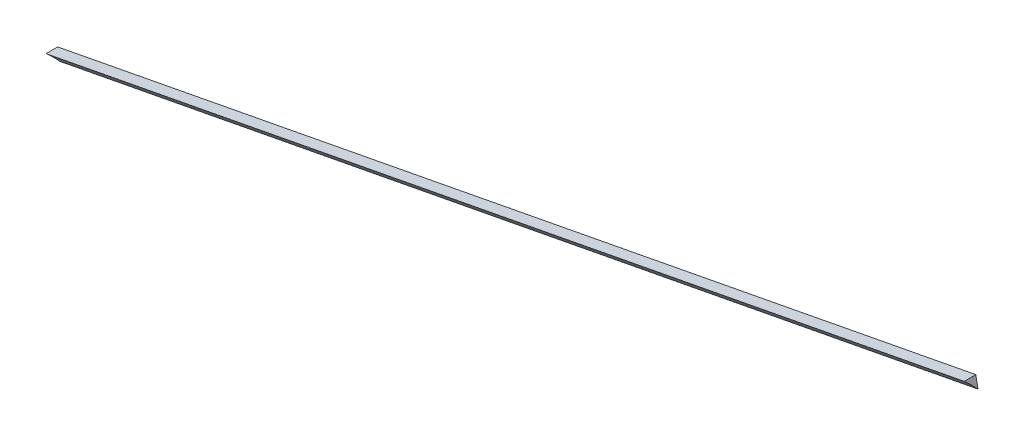
ISO-10303-21;
HEADER;
FILE_DESCRIPTION(('STEP AP214'),'2;1');
FILE_NAME('part.step','',(''),(''),'','','');
FILE_SCHEMA(('AUTOMOTIVE_DESIGN { 1 0 10303 214 1 1 1 1 }'));
ENDSEC;
DATA;
#1=APPLICATION_CONTEXT('core data for automotive mechanical design processes');
#2=APPLICATION_PROTOCOL_DEFINITION('international standard','automotive_design',2000,#1);
#3=PRODUCT_CONTEXT('',#1,'mechanical');
#4=PRODUCT('Part','Part','',(#3));
#5=PRODUCT_RELATED_PRODUCT_CATEGORY('part','',(#4));
#6=PRODUCT_DEFINITION_FORMATION('','',#4);
#7=PRODUCT_DEFINITION_CONTEXT('part definition',#1,'design');
#8=PRODUCT_DEFINITION('design','',#6,#7);
#9=PRODUCT_DEFINITION_SHAPE('','',#8);
#10=(LENGTH_UNIT() NAMED_UNIT(*) SI_UNIT(.MILLI.,.METRE.));
#11=(NAMED_UNIT(*) PLANE_ANGLE_UNIT() SI_UNIT($,.RADIAN.));
#12=(NAMED_UNIT(*) SI_UNIT($,.STERADIAN.) SOLID_ANGLE_UNIT());
#13=UNCERTAINTY_MEASURE_WITH_UNIT(LENGTH_MEASURE(1.E-05),#10,'distance_accuracy_value','');
#14=(GEOMETRIC_REPRESENTATION_CONTEXT(3) GLOBAL_UNCERTAINTY_ASSIGNED_CONTEXT((#13)) GLOBAL_UNIT_ASSIGNED_CONTEXT((#10,
#11,#12)) REPRESENTATION_CONTEXT('',''));
#15=CARTESIAN_POINT('',(0.,0.,0.));
#16=DIRECTION('',(0.,0.,1.));
#17=DIRECTION('',(1.,0.,0.));
#18=AXIS2_PLACEMENT_3D('',#15,#16,#17);
#19=CARTESIAN_POINT('',(1540.625,-104.467938085316,0.));
#20=DIRECTION('',(0.,0.,1.));
#21=DIRECTION('',(0.187499999999999,-0.982264602843857,0.));
#22=AXIS2_PLACEMENT_3D('',#19,#20,#21);
#23=PLANE('',#22);
#24=DIRECTION('',(0.187499999999999,-0.982264602843857,0.));
#25=VECTOR('',#24,1.);
#26=CARTESIAN_POINT('',(754.813317724915,-254.467938085315,0.));
#27=LINE('',#26,#25);
#28=CARTESIAN_POINT('',(749.188317724915,-225.,0.));
#29=VERTEX_POINT('',#28);
#30=CARTESIAN_POINT('',(751.063317725042,-234.822646029021,2.06861990474389E-10));
#31=VERTEX_POINT('',#30);
#32=EDGE_CURVE('E107',#29,#31,#27,.T.);
#33=ORIENTED_EDGE('',*,*,#32,.F.);
#34=DIRECTION('',(-0.982264602843857,-0.1875,0.));
#35=VECTOR('',#34,1.);
#36=CARTESIAN_POINT('',(1535.,-75.,0.));
#37=LINE('',#36,#35);
#38=CARTESIAN_POINT('',(1535.,-75.,0.));
#39=VERTEX_POINT('',#38);
#40=EDGE_CURVE('E87',#39,#29,#37,.T.);
#41=ORIENTED_EDGE('',*,*,#40,.F.);
#42=DIRECTION('',(-0.187499999999999,0.982264602843857,0.));
#43=VECTOR('',#42,1.);
#44=CARTESIAN_POINT('',(1540.625,-104.467938085316,0.));
#45=LINE('',#44,#43);
#46=CARTESIAN_POINT('',(1536.87500000001,-84.822646028422,1.20733608039053E-11));
#47=VERTEX_POINT('',#46);
#48=EDGE_CURVE('E90',#47,#39,#45,.T.);
#49=ORIENTED_EDGE('',*,*,#48,.F.);
#50=DIRECTION('',(-0.982264602843767,-0.187500000000474,4.87079449789036E-13));
#51=VECTOR('',#50,1.);
#52=CARTESIAN_POINT('',(1536.87499999999,-84.8226460284114,2.40779618465581E-11));
#53=LINE('',#52,#51);
#54=EDGE_CURVE('E61',#31,#47,#53,.F.);
#55=ORIENTED_EDGE('',*,*,#54,.F.);
#56=EDGE_LOOP('',(#33,#41,#49,#55));
#57=FACE_BOUND('',#56,.T.);
#58=ADVANCED_FACE('F57',(#57),#23,.F.);
#59=CARTESIAN_POINT('',(763.36749705697,-299.281098428057,75.6222897710008));
#60=DIRECTION('',(0.982264602843867,0.187499999999948,0.));
#61=DIRECTION('',(-0.187499999999948,0.982264602843867,0.));
#62=AXIS2_PLACEMENT_3D('',#59,#60,#61);
#63=PLANE('',#62);
#64=DIRECTION('',(0.,0.,-1.));
#65=VECTOR('',#64,1.);
#66=CARTESIAN_POINT('',(749.188317724915,-225.,0.));
#67=LINE('',#66,#65);
#68=CARTESIAN_POINT('',(749.188317724967,-225.000000000186,10.0000000006119));
#69=VERTEX_POINT('',#68);
#70=EDGE_CURVE('E106',#69,#29,#67,.T.);
#71=ORIENTED_EDGE('',*,*,#70,.T.);
#72=ORIENTED_EDGE('',*,*,#32,.T.);
#73=CARTESIAN_POINT('',(763.367497057117,-299.281098428422,75.6222897713917));
#74=DIRECTION('',(-0.982264602843767,-0.187500000000474,4.87079449789036E-13));
#75=DIRECTION('',(0.187500000000474,-0.982264602843767,0.));
#76=AXIS2_PLACEMENT_3D('',#73,#74,#75);
#77=CIRCLE('',#76,100.124999999993);
#78=EDGE_CURVE('E100',#69,#31,#77,.T.);
#79=ORIENTED_EDGE('',*,*,#78,.F.);
#80=EDGE_LOOP('',(#71,#72,#79));
#81=FACE_BOUND('',#80,.T.);
#82=ADVANCED_FACE('F121',(#81),#63,.F.);
#83=CARTESIAN_POINT('',(1535.,-75.,15.));
#84=DIRECTION('',(-0.1875,0.982264602843857,0.));
#85=DIRECTION('',(-0.982264602843857,-0.1875,0.));
#86=AXIS2_PLACEMENT_3D('',#83,#84,#85);
#87=PLANE('',#86);
#88=ORIENTED_EDGE('',*,*,#40,.T.);
#89=ORIENTED_EDGE('',*,*,#70,.F.);
#90=DIRECTION('',(-0.982264602843767,-0.187500000000474,4.87079449789036E-13));
#91=VECTOR('',#90,1.);
#92=CARTESIAN_POINT('',(1535.,-75.,10.0000000000001));
#93=LINE('',#92,#91);
#94=CARTESIAN_POINT('',(1535.00000000002,-74.9999999999969,10.));
#95=VERTEX_POINT('',#94);
#96=EDGE_CURVE('E67',#95,#69,#93,.T.);
#97=ORIENTED_EDGE('',*,*,#96,.F.);
#98=DIRECTION('',(0.,0.,1.));
#99=VECTOR('',#98,1.);
#100=CARTESIAN_POINT('',(1535.,-74.9999999999999,-250.));
#101=LINE('',#100,#99);
#102=EDGE_CURVE('E94',#39,#95,#101,.T.);
#103=ORIENTED_EDGE('',*,*,#102,.F.);
#104=EDGE_LOOP('',(#88,#89,#97,#103));
#105=FACE_BOUND('',#104,.T.);
#106=ADVANCED_FACE('F123',(#105),#87,.T.);
#107=CARTESIAN_POINT('',(1549.17917933212,-149.281098428048,75.6222897710046));
#108=DIRECTION('',(0.98226460284378,0.187500000000404,-4.25633911355086E-13));
#109=DIRECTION('',(-0.187500000000404,0.98226460284378,0.));
#110=AXIS2_PLACEMENT_3D('',#107,#108,#109);
#111=PLANE('',#110);
#112=ORIENTED_EDGE('',*,*,#102,.T.);
#113=CARTESIAN_POINT('',(1549.17917933213,-149.281098428043,75.6222897710021));
#114=DIRECTION('',(-0.982264602843767,-0.187500000000474,4.87079449789036E-13));
#115=DIRECTION('',(0.187500000000474,-0.982264602843767,0.));
#116=AXIS2_PLACEMENT_3D('',#113,#114,#115);
#117=CIRCLE('',#116,100.124999999993);
#118=EDGE_CURVE('E12',#47,#95,#117,.F.);
#119=ORIENTED_EDGE('',*,*,#118,.F.);
#120=ORIENTED_EDGE('',*,*,#48,.T.);
#121=EDGE_LOOP('',(#112,#119,#120));
#122=FACE_BOUND('',#121,.T.);
#123=ADVANCED_FACE('F96',(#122),#111,.T.);
#124=CARTESIAN_POINT('',(1549.17917933213,-149.281098428043,75.6222897710021));
#125=DIRECTION('',(-0.982264602843767,-0.187500000000474,4.87079449789036E-13));
#126=DIRECTION('',(0.187500000000474,-0.982264602843767,0.));
#127=AXIS2_PLACEMENT_3D('',#124,#125,#126);
#128=CYLINDRICAL_SURFACE('',#127,100.124999999993);
#129=ORIENTED_EDGE('',*,*,#118,.T.);
#130=ORIENTED_EDGE('',*,*,#96,.T.);
#131=ORIENTED_EDGE('',*,*,#78,.T.);
#132=ORIENTED_EDGE('',*,*,#54,.T.);
#133=EDGE_LOOP('',(#129,#130,#131,#132));
#134=FACE_BOUND('',#133,.T.);
#135=ADVANCED_FACE('F59',(#134),#128,.F.);
#136=CLOSED_SHELL('',(#58,#82,#106,#123,#135));
#137=MANIFOLD_SOLID_BREP('B2',#136);
#138=ADVANCED_BREP_SHAPE_REPRESENTATION('',(#18,#137),#14);
#139=SHAPE_DEFINITION_REPRESENTATION(#9,#138);
ENDSEC;
END-ISO-10303-21;
